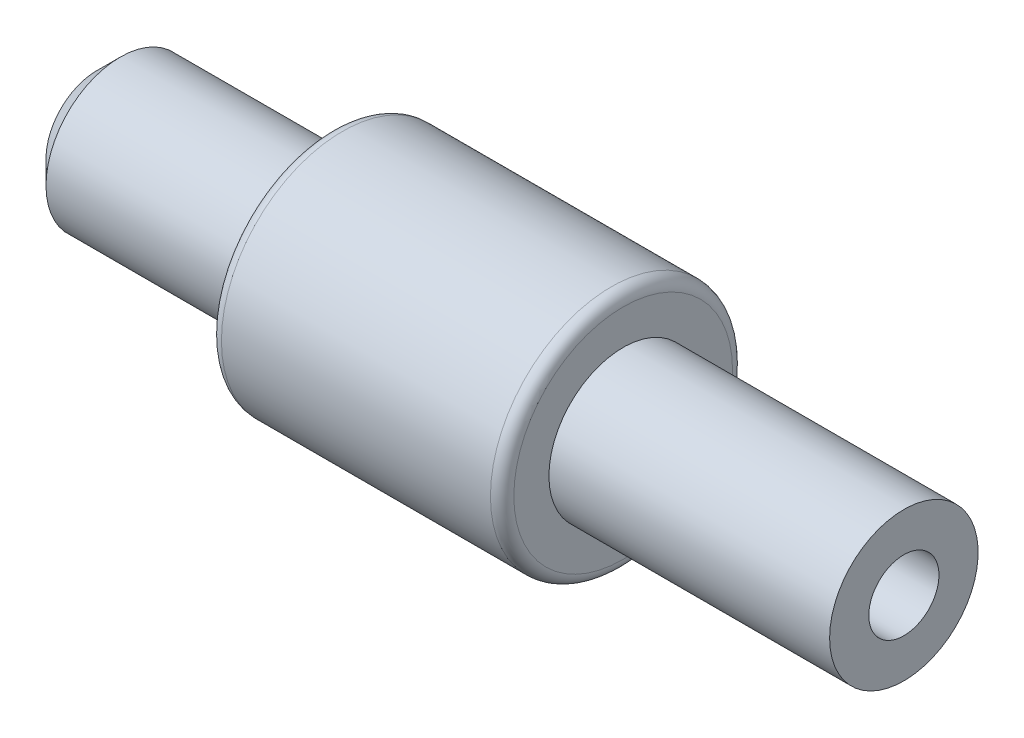
ISO-10303-21;
HEADER;
FILE_DESCRIPTION(('STEP AP214'),'2;1');
FILE_NAME('part.step','',(''),(''),'','','');
FILE_SCHEMA(('AUTOMOTIVE_DESIGN { 1 0 10303 214 1 1 1 1 }'));
ENDSEC;
DATA;
#1=APPLICATION_CONTEXT('core data for automotive mechanical design processes');
#2=APPLICATION_PROTOCOL_DEFINITION('international standard','automotive_design',2000,#1);
#3=PRODUCT_CONTEXT('',#1,'mechanical');
#4=PRODUCT('Part','Part','',(#3));
#5=PRODUCT_RELATED_PRODUCT_CATEGORY('part','',(#4));
#6=PRODUCT_DEFINITION_FORMATION('','',#4);
#7=PRODUCT_DEFINITION_CONTEXT('part definition',#1,'design');
#8=PRODUCT_DEFINITION('design','',#6,#7);
#9=PRODUCT_DEFINITION_SHAPE('','',#8);
#10=(LENGTH_UNIT() NAMED_UNIT(*) SI_UNIT(.MILLI.,.METRE.));
#11=(NAMED_UNIT(*) PLANE_ANGLE_UNIT() SI_UNIT($,.RADIAN.));
#12=(NAMED_UNIT(*) SI_UNIT($,.STERADIAN.) SOLID_ANGLE_UNIT());
#13=UNCERTAINTY_MEASURE_WITH_UNIT(LENGTH_MEASURE(1.E-05),#10,'distance_accuracy_value','');
#14=(GEOMETRIC_REPRESENTATION_CONTEXT(3) GLOBAL_UNCERTAINTY_ASSIGNED_CONTEXT((#13)) GLOBAL_UNIT_ASSIGNED_CONTEXT((#10,
#11,#12)) REPRESENTATION_CONTEXT('',''));
#15=CARTESIAN_POINT('',(0.,0.,0.));
#16=DIRECTION('',(0.,0.,1.));
#17=DIRECTION('',(1.,0.,0.));
#18=AXIS2_PLACEMENT_3D('',#15,#16,#17);
#19=CARTESIAN_POINT('',(24.5,1.5,0.));
#20=DIRECTION('',(-1.,0.,0.));
#21=DIRECTION('',(0.,0.,1.));
#22=AXIS2_PLACEMENT_3D('',#19,#20,#21);
#23=PLANE('',#22);
#24=CARTESIAN_POINT('',(24.5,0.,0.));
#25=DIRECTION('',(-1.,0.,0.));
#26=DIRECTION('',(0.,0.,1.));
#27=AXIS2_PLACEMENT_3D('',#24,#25,#26);
#28=CIRCLE('',#27,3.175);
#29=CARTESIAN_POINT('',(24.5,0.,3.175));
#30=VERTEX_POINT('',#29);
#31=EDGE_CURVE('E55',#30,#30,#28,.T.);
#32=ORIENTED_EDGE('',*,*,#31,.F.);
#33=EDGE_LOOP('',(#32));
#34=FACE_BOUND('',#33,.T.);
#35=CARTESIAN_POINT('',(24.5,0.,0.));
#36=DIRECTION('',(-1.,0.,0.));
#37=DIRECTION('',(0.,0.,1.));
#38=AXIS2_PLACEMENT_3D('',#35,#36,#37);
#39=CIRCLE('',#38,1.5);
#40=CARTESIAN_POINT('',(24.5,0.,1.5));
#41=VERTEX_POINT('',#40);
#42=EDGE_CURVE('E67',#41,#41,#39,.T.);
#43=ORIENTED_EDGE('',*,*,#42,.T.);
#44=EDGE_LOOP('',(#43));
#45=FACE_BOUND('',#44,.T.);
#46=ADVANCED_FACE('F29',(#34,#45),#23,.F.);
#47=CARTESIAN_POINT('',(-42.9413156251379,0.,0.));
#48=DIRECTION('',(-1.,0.,0.));
#49=DIRECTION('',(0.,0.,1.));
#50=AXIS2_PLACEMENT_3D('',#47,#48,#49);
#51=CYLINDRICAL_SURFACE('',#50,3.175);
#52=CARTESIAN_POINT('',(12.5,0.,0.));
#53=DIRECTION('',(-1.,0.,0.));
#54=DIRECTION('',(0.,0.,1.));
#55=AXIS2_PLACEMENT_3D('',#52,#53,#54);
#56=CIRCLE('',#55,3.175);
#57=CARTESIAN_POINT('',(12.5,0.,3.175));
#58=VERTEX_POINT('',#57);
#59=EDGE_CURVE('E58',#58,#58,#56,.T.);
#60=ORIENTED_EDGE('',*,*,#59,.F.);
#61=EDGE_LOOP('',(#60));
#62=FACE_BOUND('',#61,.T.);
#63=ORIENTED_EDGE('',*,*,#31,.T.);
#64=EDGE_LOOP('',(#63));
#65=FACE_BOUND('',#64,.T.);
#66=ADVANCED_FACE('F91',(#62,#65),#51,.T.);
#67=CARTESIAN_POINT('',(12.5,3.175,0.));
#68=DIRECTION('',(-1.,0.,0.));
#69=DIRECTION('',(0.,0.,1.));
#70=AXIS2_PLACEMENT_3D('',#67,#68,#69);
#71=PLANE('',#70);
#72=CARTESIAN_POINT('',(12.5,0.,0.));
#73=DIRECTION('',(-1.,0.,0.));
#74=DIRECTION('',(0.,0.,1.));
#75=AXIS2_PLACEMENT_3D('',#72,#73,#74);
#76=CIRCLE('',#75,4.675);
#77=CARTESIAN_POINT('',(12.5,0.,4.675));
#78=VERTEX_POINT('',#77);
#79=EDGE_CURVE('E36',#78,#78,#76,.F.);
#80=ORIENTED_EDGE('',*,*,#79,.T.);
#81=EDGE_LOOP('',(#80));
#82=FACE_BOUND('',#81,.T.);
#83=ORIENTED_EDGE('',*,*,#59,.T.);
#84=EDGE_LOOP('',(#83));
#85=FACE_BOUND('',#84,.T.);
#86=ADVANCED_FACE('F97',(#82,#85),#71,.F.);
#87=CARTESIAN_POINT('',(-42.9413156251379,0.,0.));
#88=DIRECTION('',(-1.,0.,0.));
#89=DIRECTION('',(0.,0.,1.));
#90=AXIS2_PLACEMENT_3D('',#87,#88,#89);
#91=CYLINDRICAL_SURFACE('',#90,5.175);
#92=CARTESIAN_POINT('',(12.,0.,0.));
#93=DIRECTION('',(-1.,0.,0.));
#94=DIRECTION('',(0.,0.,1.));
#95=AXIS2_PLACEMENT_3D('',#92,#93,#94);
#96=CIRCLE('',#95,5.175);
#97=CARTESIAN_POINT('',(12.,0.,5.175));
#98=VERTEX_POINT('',#97);
#99=EDGE_CURVE('E40',#98,#98,#96,.T.);
#100=ORIENTED_EDGE('',*,*,#99,.T.);
#101=EDGE_LOOP('',(#100));
#102=FACE_BOUND('',#101,.T.);
#103=CARTESIAN_POINT('',(0.5,0.,0.));
#104=DIRECTION('',(1.,0.,0.));
#105=DIRECTION('',(0.,0.,-1.));
#106=AXIS2_PLACEMENT_3D('',#103,#104,#105);
#107=CIRCLE('',#106,5.175);
#108=CARTESIAN_POINT('',(0.5,0.,-5.175));
#109=VERTEX_POINT('',#108);
#110=EDGE_CURVE('E44',#109,#109,#107,.T.);
#111=ORIENTED_EDGE('',*,*,#110,.T.);
#112=EDGE_LOOP('',(#111));
#113=FACE_BOUND('',#112,.T.);
#114=ADVANCED_FACE('F115',(#102,#113),#91,.T.);
#115=CARTESIAN_POINT('',(0.,5.175,0.));
#116=DIRECTION('',(1.,0.,0.));
#117=DIRECTION('',(0.,0.,-1.));
#118=AXIS2_PLACEMENT_3D('',#115,#116,#117);
#119=PLANE('',#118);
#120=CARTESIAN_POINT('',(0.,0.,0.));
#121=DIRECTION('',(1.,0.,0.));
#122=DIRECTION('',(0.,0.,-1.));
#123=AXIS2_PLACEMENT_3D('',#120,#121,#122);
#124=CIRCLE('',#123,4.675);
#125=CARTESIAN_POINT('',(0.,0.,-4.675));
#126=VERTEX_POINT('',#125);
#127=EDGE_CURVE('E10',#126,#126,#124,.F.);
#128=ORIENTED_EDGE('',*,*,#127,.T.);
#129=EDGE_LOOP('',(#128));
#130=FACE_BOUND('',#129,.T.);
#131=CARTESIAN_POINT('',(0.,0.,0.));
#132=DIRECTION('',(-1.,0.,0.));
#133=DIRECTION('',(0.,0.,1.));
#134=AXIS2_PLACEMENT_3D('',#131,#132,#133);
#135=CIRCLE('',#134,3.175);
#136=CARTESIAN_POINT('',(0.,0.,3.175));
#137=VERTEX_POINT('',#136);
#138=EDGE_CURVE('E61',#137,#137,#135,.T.);
#139=ORIENTED_EDGE('',*,*,#138,.F.);
#140=EDGE_LOOP('',(#139));
#141=FACE_BOUND('',#140,.T.);
#142=ADVANCED_FACE('F87',(#130,#141),#119,.F.);
#143=CARTESIAN_POINT('',(-42.9413156251379,0.,0.));
#144=DIRECTION('',(-1.,0.,0.));
#145=DIRECTION('',(0.,0.,1.));
#146=AXIS2_PLACEMENT_3D('',#143,#144,#145);
#147=CYLINDRICAL_SURFACE('',#146,3.175);
#148=CARTESIAN_POINT('',(-9.00000000000001,0.,0.));
#149=DIRECTION('',(1.,0.,0.));
#150=DIRECTION('',(0.,0.,-1.));
#151=AXIS2_PLACEMENT_3D('',#148,#149,#150);
#152=CIRCLE('',#151,3.175);
#153=CARTESIAN_POINT('',(-9.00000000000001,0.,-3.175));
#154=VERTEX_POINT('',#153);
#155=EDGE_CURVE('E49',#154,#154,#152,.T.);
#156=ORIENTED_EDGE('',*,*,#155,.T.);
#157=EDGE_LOOP('',(#156));
#158=FACE_BOUND('',#157,.T.);
#159=ORIENTED_EDGE('',*,*,#138,.T.);
#160=EDGE_LOOP('',(#159));
#161=FACE_BOUND('',#160,.T.);
#162=ADVANCED_FACE('F81',(#158,#161),#147,.T.);
#163=CARTESIAN_POINT('',(-10.,3.175,0.));
#164=DIRECTION('',(1.,0.,0.));
#165=DIRECTION('',(0.,0.,-1.));
#166=AXIS2_PLACEMENT_3D('',#163,#164,#165);
#167=PLANE('',#166);
#168=CARTESIAN_POINT('',(-10.,0.,0.));
#169=DIRECTION('',(1.,0.,0.));
#170=DIRECTION('',(0.,0.,-1.));
#171=AXIS2_PLACEMENT_3D('',#168,#169,#170);
#172=CIRCLE('',#171,2.17500000000001);
#173=CARTESIAN_POINT('',(-10.,0.,-2.17500000000001));
#174=VERTEX_POINT('',#173);
#175=EDGE_CURVE('E52',#174,#174,#172,.F.);
#176=ORIENTED_EDGE('',*,*,#175,.T.);
#177=EDGE_LOOP('',(#176));
#178=FACE_BOUND('',#177,.T.);
#179=CARTESIAN_POINT('',(-10.,0.,0.));
#180=DIRECTION('',(-1.,0.,0.));
#181=DIRECTION('',(0.,0.,1.));
#182=AXIS2_PLACEMENT_3D('',#179,#180,#181);
#183=CIRCLE('',#182,1.5);
#184=CARTESIAN_POINT('',(-10.,0.,1.5));
#185=VERTEX_POINT('',#184);
#186=EDGE_CURVE('E64',#185,#185,#183,.T.);
#187=ORIENTED_EDGE('',*,*,#186,.F.);
#188=EDGE_LOOP('',(#187));
#189=FACE_BOUND('',#188,.T.);
#190=ADVANCED_FACE('F76',(#178,#189),#167,.F.);
#191=CARTESIAN_POINT('',(-42.9413156251379,0.,0.));
#192=DIRECTION('',(-1.,0.,0.));
#193=DIRECTION('',(0.,0.,1.));
#194=AXIS2_PLACEMENT_3D('',#191,#192,#193);
#195=CYLINDRICAL_SURFACE('',#194,1.5);
#196=ORIENTED_EDGE('',*,*,#42,.F.);
#197=EDGE_LOOP('',(#196));
#198=FACE_BOUND('',#197,.T.);
#199=ORIENTED_EDGE('',*,*,#186,.T.);
#200=EDGE_LOOP('',(#199));
#201=FACE_BOUND('',#200,.T.);
#202=ADVANCED_FACE('F72',(#198,#201),#195,.F.);
#203=CARTESIAN_POINT('',(-10.,0.,0.));
#204=DIRECTION('',(1.,0.,0.));
#205=DIRECTION('',(0.,0.,-1.));
#206=AXIS2_PLACEMENT_3D('',#203,#204,#205);
#207=CONICAL_SURFACE('',#206,2.17500000000001,0.785398163397445);
#208=ORIENTED_EDGE('',*,*,#155,.F.);
#209=EDGE_LOOP('',(#208));
#210=FACE_BOUND('',#209,.T.);
#211=ORIENTED_EDGE('',*,*,#175,.F.);
#212=EDGE_LOOP('',(#211));
#213=FACE_BOUND('',#212,.T.);
#214=ADVANCED_FACE('F75',(#210,#213),#207,.T.);
#215=CARTESIAN_POINT('',(12.,0.,0.));
#216=DIRECTION('',(-1.,0.,0.));
#217=DIRECTION('',(0.,0.,1.));
#218=AXIS2_PLACEMENT_3D('',#215,#216,#217);
#219=TOROIDAL_SURFACE('',#218,4.675,0.5);
#220=ORIENTED_EDGE('',*,*,#79,.F.);
#221=EDGE_LOOP('',(#220));
#222=FACE_BOUND('',#221,.T.);
#223=ORIENTED_EDGE('',*,*,#99,.F.);
#224=EDGE_LOOP('',(#223));
#225=FACE_BOUND('',#224,.T.);
#226=ADVANCED_FACE('F104',(#222,#225),#219,.T.);
#227=CARTESIAN_POINT('',(0.5,0.,0.));
#228=DIRECTION('',(1.,0.,0.));
#229=DIRECTION('',(0.,0.,-1.));
#230=AXIS2_PLACEMENT_3D('',#227,#228,#229);
#231=TOROIDAL_SURFACE('',#230,4.675,0.5);
#232=ORIENTED_EDGE('',*,*,#110,.F.);
#233=EDGE_LOOP('',(#232));
#234=FACE_BOUND('',#233,.T.);
#235=ORIENTED_EDGE('',*,*,#127,.F.);
#236=EDGE_LOOP('',(#235));
#237=FACE_BOUND('',#236,.T.);
#238=ADVANCED_FACE('F31',(#234,#237),#231,.T.);
#239=CLOSED_SHELL('',(#46,#66,#86,#114,#142,#162,#190,#202,#214,#226,#238));
#240=MANIFOLD_SOLID_BREP('B2',#239);
#241=ADVANCED_BREP_SHAPE_REPRESENTATION('',(#18,#240),#14);
#242=SHAPE_DEFINITION_REPRESENTATION(#9,#241);
ENDSEC;
END-ISO-10303-21;
